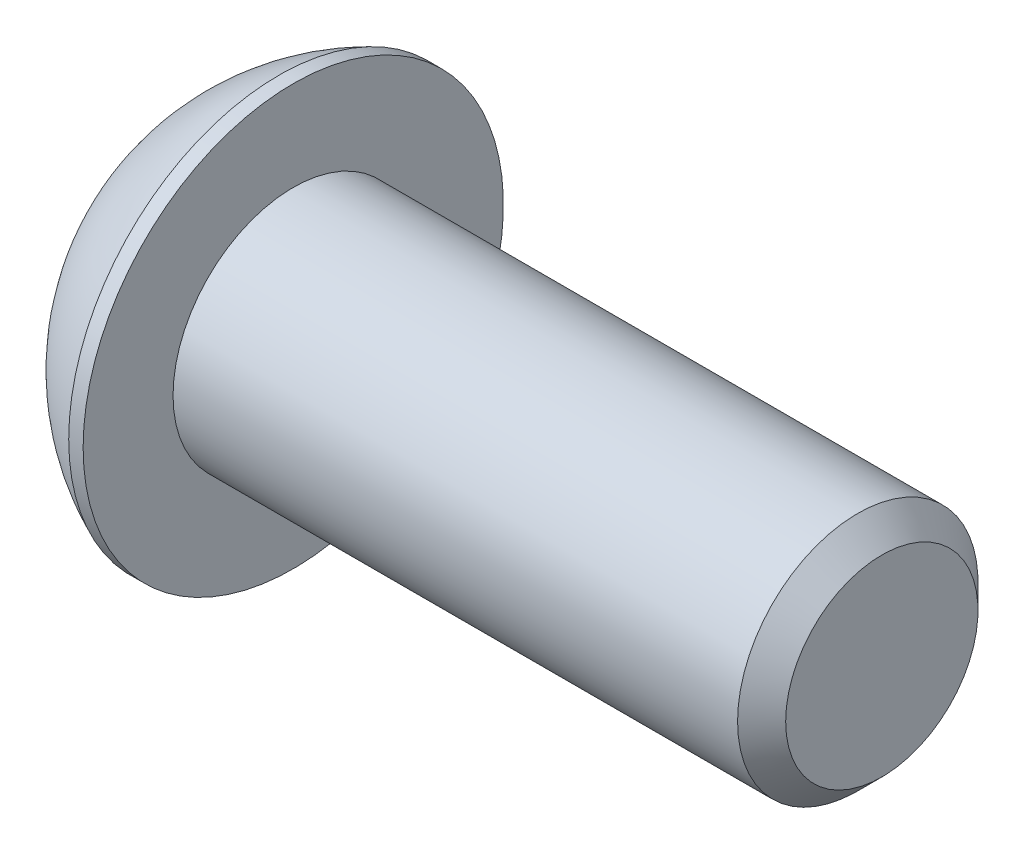
ISO-10303-21;
HEADER;
FILE_DESCRIPTION(('STEP AP214'),'2;1');
FILE_NAME('part.step','',(''),(''),'','','');
FILE_SCHEMA(('AUTOMOTIVE_DESIGN { 1 0 10303 214 1 1 1 1 }'));
ENDSEC;
DATA;
#1=APPLICATION_CONTEXT('core data for automotive mechanical design processes');
#2=APPLICATION_PROTOCOL_DEFINITION('international standard','automotive_design',2000,#1);
#3=PRODUCT_CONTEXT('',#1,'mechanical');
#4=PRODUCT('Part','Part','',(#3));
#5=PRODUCT_RELATED_PRODUCT_CATEGORY('part','',(#4));
#6=PRODUCT_DEFINITION_FORMATION('','',#4);
#7=PRODUCT_DEFINITION_CONTEXT('part definition',#1,'design');
#8=PRODUCT_DEFINITION('design','',#6,#7);
#9=PRODUCT_DEFINITION_SHAPE('','',#8);
#10=(LENGTH_UNIT() NAMED_UNIT(*) SI_UNIT(.MILLI.,.METRE.));
#11=(NAMED_UNIT(*) PLANE_ANGLE_UNIT() SI_UNIT($,.RADIAN.));
#12=(NAMED_UNIT(*) SI_UNIT($,.STERADIAN.) SOLID_ANGLE_UNIT());
#13=UNCERTAINTY_MEASURE_WITH_UNIT(LENGTH_MEASURE(1.E-05),#10,'distance_accuracy_value','');
#14=(GEOMETRIC_REPRESENTATION_CONTEXT(3) GLOBAL_UNCERTAINTY_ASSIGNED_CONTEXT((#13)) GLOBAL_UNIT_ASSIGNED_CONTEXT((#10,
#11,#12)) REPRESENTATION_CONTEXT('',''));
#15=CARTESIAN_POINT('',(0.,0.,0.));
#16=DIRECTION('',(0.,0.,1.));
#17=DIRECTION('',(1.,0.,0.));
#18=AXIS2_PLACEMENT_3D('',#15,#16,#17);
#19=CARTESIAN_POINT('',(1.32079999432833,0.,0.));
#20=DIRECTION('',(-1.,0.,0.));
#21=DIRECTION('',(0.,0.,1.));
#22=AXIS2_PLACEMENT_3D('',#19,#20,#21);
#23=CONICAL_SURFACE('',#22,1.19379999672553,1.04719755119985);
#24=CARTESIAN_POINT('',(2.01004074379096,0.,4.44089209850063E-13));
#25=VERTEX_POINT('',#24);
#26=VERTEX_LOOP('',#25);
#27=FACE_BOUND('',#26,.T.);
#28=CARTESIAN_POINT('',(1.32079999432833,0.,0.));
#29=DIRECTION('',(-1.,0.,0.));
#30=DIRECTION('',(0.,0.,1.));
#31=AXIS2_PLACEMENT_3D('',#28,#29,#30);
#32=CIRCLE('',#31,1.19379999672553);
#33=CARTESIAN_POINT('',(1.32079999432833,0.,1.19379999672553));
#34=VERTEX_POINT('',#33);
#35=EDGE_CURVE('E20',#34,#34,#32,.T.);
#36=ORIENTED_EDGE('',*,*,#35,.T.);
#37=EDGE_LOOP('',(#36));
#38=FACE_BOUND('',#37,.T.);
#39=ADVANCED_FACE('F17',(#27,#38),#23,.F.);
#40=CARTESIAN_POINT('',(1.3208,-2.29135888085,0.));
#41=DIRECTION('',(1.,0.,0.));
#42=DIRECTION('',(0.,0.,-1.));
#43=AXIS2_PLACEMENT_3D('',#40,#41,#42);
#44=PLANE('',#43);
#45=ORIENTED_EDGE('',*,*,#35,.F.);
#46=EDGE_LOOP('',(#45));
#47=FACE_BOUND('',#46,.T.);
#48=DIRECTION('',(0.,1.,0.));
#49=VECTOR('',#48,1.);
#50=CARTESIAN_POINT('',(1.3208,-1.14567944042,1.984375));
#51=LINE('',#50,#49);
#52=CARTESIAN_POINT('',(1.3208,1.1456794404025,1.984375));
#53=VERTEX_POINT('',#52);
#54=CARTESIAN_POINT('',(1.3208,-1.14567944045803,1.98437500000826));
#55=VERTEX_POINT('',#54);
#56=EDGE_CURVE('E134',#53,#55,#51,.F.);
#57=ORIENTED_EDGE('',*,*,#56,.F.);
#58=DIRECTION('',(0.,0.50000000000019,-0.866025403784329));
#59=VECTOR('',#58,1.);
#60=CARTESIAN_POINT('',(1.3208,1.14567944042,1.984375));
#61=LINE('',#60,#59);
#62=CARTESIAN_POINT('',(1.3208,2.29135888083945,1.55612149685055E-11));
#63=VERTEX_POINT('',#62);
#64=EDGE_CURVE('E116',#63,#53,#61,.F.);
#65=ORIENTED_EDGE('',*,*,#64,.F.);
#66=DIRECTION('',(0.,-0.50000000000019,-0.866025403784329));
#67=VECTOR('',#66,1.);
#68=CARTESIAN_POINT('',(1.3208,2.29135888085,0.));
#69=LINE('',#68,#67);
#70=CARTESIAN_POINT('',(1.3208,1.1456794404168,-1.98437500000826));
#71=VERTEX_POINT('',#70);
#72=EDGE_CURVE('E88',#71,#63,#69,.F.);
#73=ORIENTED_EDGE('',*,*,#72,.F.);
#74=DIRECTION('',(0.,1.,0.));
#75=VECTOR('',#74,1.);
#76=CARTESIAN_POINT('',(1.3208,1.14567944042,-1.984375));
#77=LINE('',#76,#75);
#78=CARTESIAN_POINT('',(1.3208,-1.1456794404025,-1.984375));
#79=VERTEX_POINT('',#78);
#80=EDGE_CURVE('E85',#79,#71,#77,.T.);
#81=ORIENTED_EDGE('',*,*,#80,.F.);
#82=DIRECTION('',(0.,-0.50000000000019,0.866025403784329));
#83=VECTOR('',#82,1.);
#84=CARTESIAN_POINT('',(1.3208,-1.14567944042,-1.984375));
#85=LINE('',#84,#83);
#86=CARTESIAN_POINT('',(1.3208,-2.29135888083945,-1.55606780336135E-11));
#87=VERTEX_POINT('',#86);
#88=EDGE_CURVE('E124',#87,#79,#85,.F.);
#89=ORIENTED_EDGE('',*,*,#88,.F.);
#90=DIRECTION('',(0.,0.50000000000019,0.866025403784329));
#91=VECTOR('',#90,1.);
#92=CARTESIAN_POINT('',(1.3208,-2.29135888085,0.));
#93=LINE('',#92,#91);
#94=EDGE_CURVE('E129',#55,#87,#93,.F.);
#95=ORIENTED_EDGE('',*,*,#94,.F.);
#96=EDGE_LOOP('',(#57,#65,#73,#81,#89,#95));
#97=FACE_BOUND('',#96,.T.);
#98=ADVANCED_FACE('F173',(#47,#97),#44,.F.);
#99=CARTESIAN_POINT('',(1.3208,-1.14567944042,1.984375));
#100=DIRECTION('',(0.,0.,-1.));
#101=DIRECTION('',(0.,1.,0.));
#102=AXIS2_PLACEMENT_3D('',#99,#100,#101);
#103=PLANE('',#102);
#104=ORIENTED_EDGE('',*,*,#56,.T.);
#105=DIRECTION('',(1.,0.,0.));
#106=VECTOR('',#105,1.);
#107=CARTESIAN_POINT('',(1.3208,-1.14567944040719,1.98437500003302));
#108=LINE('',#107,#106);
#109=CARTESIAN_POINT('',(0.,-1.1456794404393,1.98437500000826));
#110=VERTEX_POINT('',#109);
#111=EDGE_CURVE('E131',#110,#55,#108,.T.);
#112=ORIENTED_EDGE('',*,*,#111,.F.);
#113=DIRECTION('',(0.,1.,0.));
#114=VECTOR('',#113,1.);
#115=CARTESIAN_POINT('',(0.,0.,1.984375));
#116=LINE('',#115,#114);
#117=CARTESIAN_POINT('',(0.,1.1456794403675,1.984375));
#118=VERTEX_POINT('',#117);
#119=EDGE_CURVE('E110',#118,#110,#116,.F.);
#120=ORIENTED_EDGE('',*,*,#119,.F.);
#121=DIRECTION('',(1.,0.,0.));
#122=VECTOR('',#121,1.);
#123=CARTESIAN_POINT('',(1.3208,1.14567944042,1.984375));
#124=LINE('',#123,#122);
#125=EDGE_CURVE('E113',#53,#118,#124,.F.);
#126=ORIENTED_EDGE('',*,*,#125,.F.);
#127=EDGE_LOOP('',(#104,#112,#120,#126));
#128=FACE_BOUND('',#127,.T.);
#129=ADVANCED_FACE('F170',(#128),#103,.T.);
#130=CARTESIAN_POINT('',(1.3208,-2.29135888085,0.));
#131=DIRECTION('',(0.,0.866025403784329,-0.50000000000019));
#132=DIRECTION('',(0.,0.50000000000019,0.866025403784329));
#133=AXIS2_PLACEMENT_3D('',#130,#131,#132);
#134=PLANE('',#133);
#135=ORIENTED_EDGE('',*,*,#94,.T.);
#136=DIRECTION('',(1.,0.,0.));
#137=VECTOR('',#136,1.);
#138=CARTESIAN_POINT('',(1.3208,-2.29135888080781,-6.22431793606548E-11));
#139=LINE('',#138,#137);
#140=CARTESIAN_POINT('',(0.,-2.29135888080195,-1.55607234461392E-11));
#141=VERTEX_POINT('',#140);
#142=EDGE_CURVE('E126',#141,#87,#139,.T.);
#143=ORIENTED_EDGE('',*,*,#142,.F.);
#144=DIRECTION('',(0.,-0.499999999976052,-0.866025403798265));
#145=VECTOR('',#144,1.);
#146=CARTESIAN_POINT('',(0.,-1.14567944035,1.984375));
#147=LINE('',#146,#145);
#148=EDGE_CURVE('E105',#110,#141,#147,.T.);
#149=ORIENTED_EDGE('',*,*,#148,.F.);
#150=ORIENTED_EDGE('',*,*,#111,.T.);
#151=EDGE_LOOP('',(#135,#143,#149,#150));
#152=FACE_BOUND('',#151,.T.);
#153=ADVANCED_FACE('F166',(#152),#134,.T.);
#154=CARTESIAN_POINT('',(1.3208,-1.14567944042,-1.984375));
#155=DIRECTION('',(0.,0.866025403784329,0.50000000000019));
#156=DIRECTION('',(0.,-0.50000000000019,0.866025403784329));
#157=AXIS2_PLACEMENT_3D('',#154,#155,#156);
#158=PLANE('',#157);
#159=ORIENTED_EDGE('',*,*,#88,.T.);
#160=DIRECTION('',(1.,0.,0.));
#161=VECTOR('',#160,1.);
#162=CARTESIAN_POINT('',(1.3208,-1.14567944035,-1.984375));
#163=LINE('',#162,#161);
#164=CARTESIAN_POINT('',(0.,-1.145679440385,-1.984375));
#165=VERTEX_POINT('',#164);
#166=EDGE_CURVE('E122',#165,#79,#163,.T.);
#167=ORIENTED_EDGE('',*,*,#166,.F.);
#168=DIRECTION('',(0.,0.499999999976052,-0.866025403798265));
#169=VECTOR('',#168,1.);
#170=CARTESIAN_POINT('',(0.,-2.2913588807,0.));
#171=LINE('',#170,#169);
#172=EDGE_CURVE('E103',#141,#165,#171,.T.);
#173=ORIENTED_EDGE('',*,*,#172,.F.);
#174=ORIENTED_EDGE('',*,*,#142,.T.);
#175=EDGE_LOOP('',(#159,#167,#173,#174));
#176=FACE_BOUND('',#175,.T.);
#177=ADVANCED_FACE('F163',(#176),#158,.T.);
#178=CARTESIAN_POINT('',(1.3208,1.14567944042,-1.984375));
#179=DIRECTION('',(0.,0.,1.));
#180=DIRECTION('',(1.,0.,0.));
#181=AXIS2_PLACEMENT_3D('',#178,#179,#180);
#182=PLANE('',#181);
#183=ORIENTED_EDGE('',*,*,#80,.T.);
#184=DIRECTION('',(1.,0.,0.));
#185=VECTOR('',#184,1.);
#186=CARTESIAN_POINT('',(1.3208,1.14567944040719,-1.98437500003302));
#187=LINE('',#186,#185);
#188=CARTESIAN_POINT('',(0.,1.1456794403993,-1.98437500000826));
#189=VERTEX_POINT('',#188);
#190=EDGE_CURVE('E77',#189,#71,#187,.T.);
#191=ORIENTED_EDGE('',*,*,#190,.F.);
#192=DIRECTION('',(0.,1.,0.));
#193=VECTOR('',#192,1.);
#194=CARTESIAN_POINT('',(0.,0.,-1.984375));
#195=LINE('',#194,#193);
#196=EDGE_CURVE('E82',#165,#189,#195,.T.);
#197=ORIENTED_EDGE('',*,*,#196,.F.);
#198=ORIENTED_EDGE('',*,*,#166,.T.);
#199=EDGE_LOOP('',(#183,#191,#197,#198));
#200=FACE_BOUND('',#199,.T.);
#201=ADVANCED_FACE('F79',(#200),#182,.T.);
#202=CARTESIAN_POINT('',(1.3208,2.29135888085,0.));
#203=DIRECTION('',(0.,-0.866025403784329,0.50000000000019));
#204=DIRECTION('',(0.,-0.50000000000019,-0.866025403784329));
#205=AXIS2_PLACEMENT_3D('',#202,#203,#204);
#206=PLANE('',#205);
#207=ORIENTED_EDGE('',*,*,#72,.T.);
#208=DIRECTION('',(1.,0.,0.));
#209=VECTOR('',#208,1.);
#210=CARTESIAN_POINT('',(1.3208,2.29135888080781,6.22431793606548E-11));
#211=LINE('',#210,#209);
#212=CARTESIAN_POINT('',(0.,2.29135888080195,1.55609402865737E-11));
#213=VERTEX_POINT('',#212);
#214=EDGE_CURVE('E94',#213,#63,#211,.T.);
#215=ORIENTED_EDGE('',*,*,#214,.F.);
#216=DIRECTION('',(0.,0.499999999976052,0.866025403798265));
#217=VECTOR('',#216,1.);
#218=CARTESIAN_POINT('',(0.,1.14567944035,-1.984375));
#219=LINE('',#218,#217);
#220=EDGE_CURVE('E91',#189,#213,#219,.T.);
#221=ORIENTED_EDGE('',*,*,#220,.F.);
#222=ORIENTED_EDGE('',*,*,#190,.T.);
#223=EDGE_LOOP('',(#207,#215,#221,#222));
#224=FACE_BOUND('',#223,.T.);
#225=ADVANCED_FACE('F92',(#224),#206,.T.);
#226=CARTESIAN_POINT('',(1.3208,1.14567944042,1.984375));
#227=DIRECTION('',(0.,-0.866025403784329,-0.50000000000019));
#228=DIRECTION('',(0.,0.50000000000019,-0.866025403784329));
#229=AXIS2_PLACEMENT_3D('',#226,#227,#228);
#230=PLANE('',#229);
#231=ORIENTED_EDGE('',*,*,#64,.T.);
#232=ORIENTED_EDGE('',*,*,#125,.T.);
#233=DIRECTION('',(0.,-0.499999999976052,0.866025403798265));
#234=VECTOR('',#233,1.);
#235=CARTESIAN_POINT('',(0.,2.2913588807,0.));
#236=LINE('',#235,#234);
#237=EDGE_CURVE('E98',#213,#118,#236,.T.);
#238=ORIENTED_EDGE('',*,*,#237,.F.);
#239=ORIENTED_EDGE('',*,*,#214,.T.);
#240=EDGE_LOOP('',(#231,#232,#238,#239));
#241=FACE_BOUND('',#240,.T.);
#242=ADVANCED_FACE('F155',(#241),#230,.T.);
#243=CARTESIAN_POINT('',(0.,0.,0.));
#244=DIRECTION('',(-1.,0.,0.));
#245=DIRECTION('',(0.,0.,1.));
#246=AXIS2_PLACEMENT_3D('',#243,#244,#245);
#247=PLANE('',#246);
#248=ORIENTED_EDGE('',*,*,#220,.T.);
#249=ORIENTED_EDGE('',*,*,#237,.T.);
#250=ORIENTED_EDGE('',*,*,#119,.T.);
#251=ORIENTED_EDGE('',*,*,#148,.T.);
#252=ORIENTED_EDGE('',*,*,#172,.T.);
#253=ORIENTED_EDGE('',*,*,#196,.T.);
#254=EDGE_LOOP('',(#248,#249,#250,#251,#252,#253));
#255=FACE_BOUND('',#254,.T.);
#256=CARTESIAN_POINT('',(0.,0.,2.77495000000498));
#257=CARTESIAN_POINT('',(0.,-0.0780476189418023,2.7749574777346));
#258=CARTESIAN_POINT('',(0.,-0.156091690997,2.77165730271175));
#259=CARTESIAN_POINT('',(0.,-0.311621483993028,2.75849951311291));
#260=CARTESIAN_POINT('',(0.,-0.38910723148015,2.74864221241182));
#261=CARTESIAN_POINT('',(0.,-0.542923175998717,2.72243714479626));
#262=CARTESIAN_POINT('',(0.,-0.619254139371762,2.70609389762394));
#263=CARTESIAN_POINT('',(0.,-0.770249304507315,2.66704952043296));
#264=CARTESIAN_POINT('',(0.,-0.844913526539225,2.64434846777771));
#265=CARTESIAN_POINT('',(0.,-1.06568596776161,2.5668918761079));
#266=CARTESIAN_POINT('',(0.,-1.20863620572707,2.50277224258278));
#267=CARTESIAN_POINT('',(0.,-1.48162845017614,2.35149042805168));
#268=CARTESIAN_POINT('',(0.,-1.61167355634549,2.26433379882055));
#269=CARTESIAN_POINT('',(0.,-1.85530048203785,2.06942681171443));
#270=CARTESIAN_POINT('',(0.,-1.96888346338675,1.96167790839914));
#271=CARTESIAN_POINT('',(0.,-2.17638612604483,1.72859715533842));
#272=CARTESIAN_POINT('',(0.,-2.27029827782891,1.60325860323943));
#273=CARTESIAN_POINT('',(0.,-2.43577545577329,1.33855376914359));
#274=CARTESIAN_POINT('',(0.,-2.50733172131476,1.19918201616334));
#275=CARTESIAN_POINT('',(0.,-2.62594987301431,0.910512315267797));
#276=CARTESIAN_POINT('',(0.,-2.67304017955261,0.761226112752659));
#277=CARTESIAN_POINT('',(0.,-2.72974480799017,0.509262206015232));
#278=CARTESIAN_POINT('',(0.,-2.7466741066797,0.408170256195464));
#279=CARTESIAN_POINT('',(0.,-2.76927900228181,0.204733741062011));
#280=CARTESIAN_POINT('',(0.,-2.77495436270396,0.102389149470764));
#281=CARTESIAN_POINT('',(0.,-2.77494335790323,-0.1558849582706));
#282=CARTESIAN_POINT('',(-3.37327630179731E-13,-2.76177150806704,-0.31187319864273));
#283=CARTESIAN_POINT('',(3.38562160741123E-13,-2.70941293854891,-0.619540159108329));
#284=CARTESIAN_POINT('',(1.27983070085801E-12,-2.67019795455288,-0.771214010135769));
#285=CARTESIAN_POINT('',(1.28221982382751E-12,-2.56687014830246,-1.0657693076378));
#286=CARTESIAN_POINT('',(3.44164875918747E-13,-2.50276825401477,-1.20865458136379));
#287=CARTESIAN_POINT('',(-3.43225758051063E-13,-2.35149927682559,-1.48160130773281));
#288=CARTESIAN_POINT('',(0.,-2.26433701172623,-1.61166543120533));
#289=CARTESIAN_POINT('',(0.,-2.06941027445284,-1.85532526242913));
#290=CARTESIAN_POINT('',(0.,-1.96164444068513,-1.96891988091485));
#291=CARTESIAN_POINT('',(0.,-1.72855917863899,-2.176413309275));
#292=CARTESIAN_POINT('',(0.,-1.60323840676039,-2.27031061020308));
#293=CARTESIAN_POINT('',(0.,-1.33859668560166,-2.43574892033037));
#294=CARTESIAN_POINT('',(0.,-1.19927266628187,-2.50728501291905));
#295=CARTESIAN_POINT('',(0.,-0.910609613461349,-2.62591932801922));
#296=CARTESIAN_POINT('',(0.,-0.761275783745211,-2.67303013888595));
#297=CARTESIAN_POINT('',(0.,-0.509186402769317,-2.72976111987087));
#298=CARTESIAN_POINT('',(0.,-0.408016727031738,-2.74669741402727));
#299=CARTESIAN_POINT('',(0.,-0.204578776250972,-2.76928996300059));
#300=CARTESIAN_POINT('',(0.,-0.102312365024706,-2.77496300589831));
#301=CARTESIAN_POINT('',(0.,0.,-2.77495000000498));
#302=B_SPLINE_CURVE_WITH_KNOTS('',3,(#256,#257,#258,#259,#260,#261,#262,#263,#264,#265,#266,
#267,#268,#269,#270,#271,#272,#273,#274,#275,#276,#277,#278,#279,#280,#281,#282,#283,#284,#285,
#286,#287,#288,#289,#290,#291,#292,#293,#294,#295,#296,#297,#298,#299,#300,#301),.UNSPECIFIED.,
.F.,.F.,(4,2,2,2,2,2,2,2,2,2,2,2,2,2,2,2,2,2,2,2,2,2,4),(0.,0.234066711495954,0.468122219550207,
0.702014911241611,0.935904756990152,1.40349738510624,1.87097742884399,2.33842446377097,
2.80605010062436,3.27385875712272,3.74112277139293,4.0480390880636,4.35496185421012,
4.8222442062987,5.29003452512533,5.75761966678295,6.22510719699141,6.69262563195384,
7.16017986888879,7.62783683586065,8.09525254056861,8.40240115938039,8.70909162286251),.UNSPECIFIED.);
#303=CARTESIAN_POINT('',(0.,0.,2.77495000000498));
#304=VERTEX_POINT('',#303);
#305=CARTESIAN_POINT('',(0.,0.,-2.77495000000498));
#306=VERTEX_POINT('',#305);
#307=EDGE_CURVE('E32',#304,#306,#302,.T.);
#308=ORIENTED_EDGE('',*,*,#307,.F.);
#309=CARTESIAN_POINT('',(0.,0.,0.));
#310=DIRECTION('',(-1.,0.,0.));
#311=DIRECTION('',(0.,-1.,0.));
#312=AXIS2_PLACEMENT_3D('',#309,#310,#311);
#313=CIRCLE('',#312,2.77495000000498);
#314=EDGE_CURVE('E35',#306,#304,#313,.F.);
#315=ORIENTED_EDGE('',*,*,#314,.F.);
#316=EDGE_LOOP('',(#308,#315));
#317=FACE_BOUND('',#316,.T.);
#318=ADVANCED_FACE('F100',(#255,#317),#247,.T.);
#319=CARTESIAN_POINT('',(5.3726088141,0.,0.));
#320=DIRECTION('',(-1.,0.,0.));
#321=DIRECTION('',(0.,1.,0.));
#322=AXIS2_PLACEMENT_3D('',#319,#320,#321);
#323=SPHERICAL_SURFACE('',#322,6.04692260343);
#324=ORIENTED_EDGE('',*,*,#314,.T.);
#325=ORIENTED_EDGE('',*,*,#307,.T.);
#326=EDGE_LOOP('',(#324,#325));
#327=FACE_BOUND('',#326,.T.);
#328=CARTESIAN_POINT('',(2.97179999948,0.,0.));
#329=DIRECTION('',(-1.,0.,0.));
#330=DIRECTION('',(0.,0.,1.));
#331=AXIS2_PLACEMENT_3D('',#328,#329,#330);
#332=CIRCLE('',#331,5.5499);
#333=CARTESIAN_POINT('',(2.97179999948,0.,5.5499));
#334=VERTEX_POINT('',#333);
#335=EDGE_CURVE('E142',#334,#334,#332,.F.);
#336=ORIENTED_EDGE('',*,*,#335,.F.);
#337=EDGE_LOOP('',(#336));
#338=FACE_BOUND('',#337,.T.);
#339=ADVANCED_FACE('F154',(#327,#338),#323,.T.);
#340=CARTESIAN_POINT('',(18.8976,0.,0.));
#341=DIRECTION('',(-1.,0.,0.));
#342=DIRECTION('',(0.,0.,1.));
#343=AXIS2_PLACEMENT_3D('',#340,#341,#342);
#344=PLANE('',#343);
#345=CARTESIAN_POINT('',(18.8976000000025,0.,0.));
#346=DIRECTION('',(-1.,0.,0.));
#347=DIRECTION('',(0.,0.,1.));
#348=AXIS2_PLACEMENT_3D('',#345,#346,#347);
#349=CIRCLE('',#348,2.54000000006727);
#350=CARTESIAN_POINT('',(18.8976000000025,0.,2.54000000006727));
#351=VERTEX_POINT('',#350);
#352=EDGE_CURVE('E139',#351,#351,#349,.T.);
#353=ORIENTED_EDGE('',*,*,#352,.F.);
#354=EDGE_LOOP('',(#353));
#355=FACE_BOUND('',#354,.T.);
#356=ADVANCED_FACE('F203',(#355),#344,.F.);
#357=CARTESIAN_POINT('',(0.,0.,0.));
#358=DIRECTION('',(-1.,0.,0.));
#359=DIRECTION('',(0.,0.,1.));
#360=AXIS2_PLACEMENT_3D('',#357,#358,#359);
#361=CYLINDRICAL_SURFACE('',#360,5.5499);
#362=ORIENTED_EDGE('',*,*,#335,.T.);
#363=EDGE_LOOP('',(#362));
#364=FACE_BOUND('',#363,.T.);
#365=CARTESIAN_POINT('',(3.35280000046,0.,0.));
#366=DIRECTION('',(-1.,0.,0.));
#367=DIRECTION('',(0.,0.,1.));
#368=AXIS2_PLACEMENT_3D('',#365,#366,#367);
#369=CIRCLE('',#368,5.5499);
#370=CARTESIAN_POINT('',(3.35280000046,0.,5.5499));
#371=VERTEX_POINT('',#370);
#372=EDGE_CURVE('E136',#371,#371,#369,.T.);
#373=ORIENTED_EDGE('',*,*,#372,.T.);
#374=EDGE_LOOP('',(#373));
#375=FACE_BOUND('',#374,.T.);
#376=ADVANCED_FACE('F199',(#364,#375),#361,.T.);
#377=CARTESIAN_POINT('',(18.2626000001278,0.,0.));
#378=DIRECTION('',(-1.,0.,0.));
#379=DIRECTION('',(0.,0.,1.));
#380=AXIS2_PLACEMENT_3D('',#377,#378,#379);
#381=CONICAL_SURFACE('',#380,3.17499999988513,0.78539816335269);
#382=CARTESIAN_POINT('',(18.2626,0.,0.));
#383=DIRECTION('',(-1.,0.,0.));
#384=DIRECTION('',(0.,0.,1.));
#385=AXIS2_PLACEMENT_3D('',#382,#383,#384);
#386=CIRCLE('',#385,3.175);
#387=CARTESIAN_POINT('',(18.2626,0.,3.175));
#388=VERTEX_POINT('',#387);
#389=EDGE_CURVE('E25',#388,#388,#386,.T.);
#390=ORIENTED_EDGE('',*,*,#389,.F.);
#391=EDGE_LOOP('',(#390));
#392=FACE_BOUND('',#391,.T.);
#393=ORIENTED_EDGE('',*,*,#352,.T.);
#394=EDGE_LOOP('',(#393));
#395=FACE_BOUND('',#394,.T.);
#396=ADVANCED_FACE('F192',(#392,#395),#381,.T.);
#397=CARTESIAN_POINT('',(3.3528,3.175,0.));
#398=DIRECTION('',(-1.,0.,0.));
#399=DIRECTION('',(0.,0.,1.));
#400=AXIS2_PLACEMENT_3D('',#397,#398,#399);
#401=PLANE('',#400);
#402=CARTESIAN_POINT('',(3.35280000046,0.,0.));
#403=DIRECTION('',(-1.,0.,0.));
#404=DIRECTION('',(0.,0.,1.));
#405=AXIS2_PLACEMENT_3D('',#402,#403,#404);
#406=CIRCLE('',#405,3.175);
#407=CARTESIAN_POINT('',(3.35280000046,0.,3.175));
#408=VERTEX_POINT('',#407);
#409=EDGE_CURVE('E11',#408,#408,#406,.F.);
#410=ORIENTED_EDGE('',*,*,#409,.F.);
#411=EDGE_LOOP('',(#410));
#412=FACE_BOUND('',#411,.T.);
#413=ORIENTED_EDGE('',*,*,#372,.F.);
#414=EDGE_LOOP('',(#413));
#415=FACE_BOUND('',#414,.T.);
#416=ADVANCED_FACE('F186',(#412,#415),#401,.F.);
#417=CARTESIAN_POINT('',(0.,0.,0.));
#418=DIRECTION('',(-1.,0.,0.));
#419=DIRECTION('',(0.,0.,1.));
#420=AXIS2_PLACEMENT_3D('',#417,#418,#419);
#421=CYLINDRICAL_SURFACE('',#420,3.175);
#422=ORIENTED_EDGE('',*,*,#409,.T.);
#423=EDGE_LOOP('',(#422));
#424=FACE_BOUND('',#423,.T.);
#425=ORIENTED_EDGE('',*,*,#389,.T.);
#426=EDGE_LOOP('',(#425));
#427=FACE_BOUND('',#426,.T.);
#428=ADVANCED_FACE('F184',(#424,#427),#421,.T.);
#429=CLOSED_SHELL('',(#39,#98,#129,#153,#177,#201,#225,#242,#318,#339,#356,#376,#396,#416,#428));
#430=MANIFOLD_SOLID_BREP('B1',#429);
#431=ADVANCED_BREP_SHAPE_REPRESENTATION('',(#18,#430),#14);
#432=SHAPE_DEFINITION_REPRESENTATION(#9,#431);
ENDSEC;
END-ISO-10303-21;
